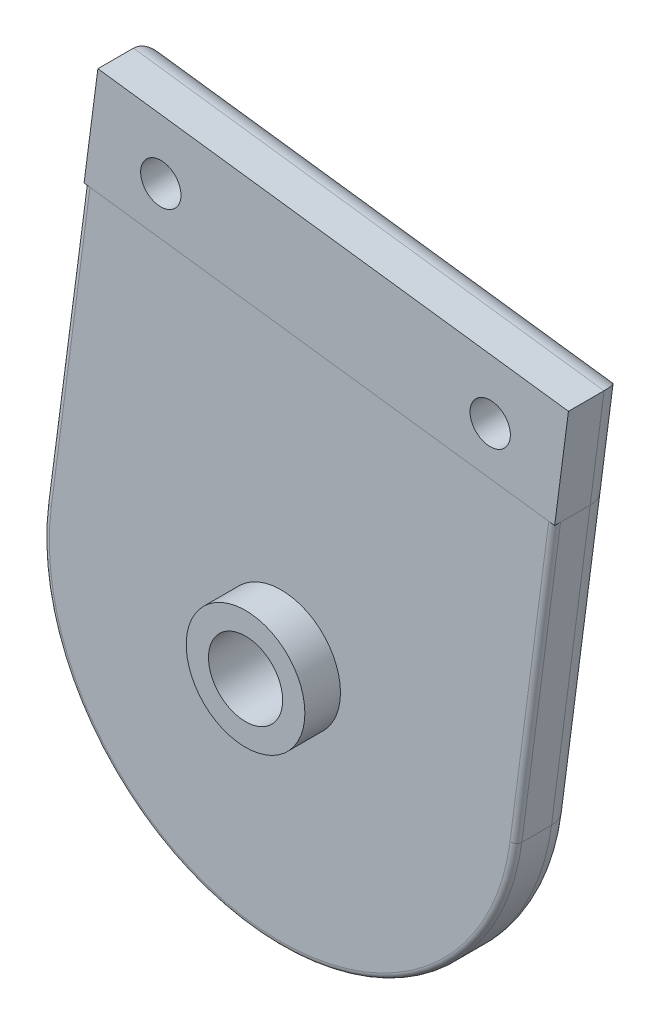
ISO-10303-21;
HEADER;
FILE_DESCRIPTION(('STEP AP214'),'2;1');
FILE_NAME('part.step','',(''),(''),'','','');
FILE_SCHEMA(('AUTOMOTIVE_DESIGN { 1 0 10303 214 1 1 1 1 }'));
ENDSEC;
DATA;
#1=APPLICATION_CONTEXT('core data for automotive mechanical design processes');
#2=APPLICATION_PROTOCOL_DEFINITION('international standard','automotive_design',2000,#1);
#3=PRODUCT_CONTEXT('',#1,'mechanical');
#4=PRODUCT('Part','Part','',(#3));
#5=PRODUCT_RELATED_PRODUCT_CATEGORY('part','',(#4));
#6=PRODUCT_DEFINITION_FORMATION('','',#4);
#7=PRODUCT_DEFINITION_CONTEXT('part definition',#1,'design');
#8=PRODUCT_DEFINITION('design','',#6,#7);
#9=PRODUCT_DEFINITION_SHAPE('','',#8);
#10=(LENGTH_UNIT() NAMED_UNIT(*) SI_UNIT(.MILLI.,.METRE.));
#11=(NAMED_UNIT(*) PLANE_ANGLE_UNIT() SI_UNIT($,.RADIAN.));
#12=(NAMED_UNIT(*) SI_UNIT($,.STERADIAN.) SOLID_ANGLE_UNIT());
#13=UNCERTAINTY_MEASURE_WITH_UNIT(LENGTH_MEASURE(1.E-05),#10,'distance_accuracy_value','');
#14=(GEOMETRIC_REPRESENTATION_CONTEXT(3) GLOBAL_UNCERTAINTY_ASSIGNED_CONTEXT((#13)) GLOBAL_UNIT_ASSIGNED_CONTEXT((#10,
#11,#12)) REPRESENTATION_CONTEXT('',''));
#15=CARTESIAN_POINT('',(0.,0.,0.));
#16=DIRECTION('',(0.,0.,1.));
#17=DIRECTION('',(1.,0.,0.));
#18=AXIS2_PLACEMENT_3D('',#15,#16,#17);
#19=CARTESIAN_POINT('',(158.704164506247,239.24941544385,77.3233826978489));
#20=DIRECTION('',(0.,0.,1.));
#21=DIRECTION('',(0.991589561122965,-0.129422340698834,0.));
#22=AXIS2_PLACEMENT_3D('',#19,#20,#21);
#23=PLANE('',#22);
#24=CARTESIAN_POINT('',(138.43932962902,280.321159697273,77.3233826978489));
#25=DIRECTION('',(0.,0.,1.));
#26=DIRECTION('',(0.991589561122965,-0.129422340698834,0.));
#27=AXIS2_PLACEMENT_3D('',#24,#25,#26);
#28=CIRCLE('',#27,24.765);
#29=CARTESIAN_POINT('',(113.88261414781,283.526303964679,77.3233826978489));
#30=VERTEX_POINT('',#29);
#31=CARTESIAN_POINT('',(162.996045110231,277.116015429866,77.3233826978488));
#32=VERTEX_POINT('',#31);
#33=EDGE_CURVE('P0_E152',#30,#32,#28,.T.);
#34=ORIENTED_EDGE('',*,*,#33,.T.);
#35=DIRECTION('',(0.129422340698834,0.991589561122965,0.));
#36=VECTOR('',#35,1.);
#37=CARTESIAN_POINT('',(167.140247902772,308.867475077959,77.3233826978487));
#38=LINE('',#37,#36);
#39=CARTESIAN_POINT('',(167.140247902772,308.867475077959,77.3233826978487));
#40=VERTEX_POINT('',#39);
#41=EDGE_CURVE('P0_E154',#32,#40,#38,.T.);
#42=ORIENTED_EDGE('',*,*,#41,.T.);
#43=DIRECTION('',(-0.991589561122965,0.129422340698834,0.));
#44=VECTOR('',#43,1.);
#45=CARTESIAN_POINT('',(167.779823169696,308.783997668208,77.3233826978487));
#46=LINE('',#45,#44);
#47=CARTESIAN_POINT('',(118.026816940352,315.277763612772,77.3233826978488));
#48=VERTEX_POINT('',#47);
#49=EDGE_CURVE('P0_E132',#40,#48,#46,.T.);
#50=ORIENTED_EDGE('',*,*,#49,.T.);
#51=DIRECTION('',(-0.129422340698834,-0.991589561122965,0.));
#52=VECTOR('',#51,1.);
#53=CARTESIAN_POINT('',(113.88261414781,283.526303964679,77.3233826978489));
#54=LINE('',#53,#52);
#55=EDGE_CURVE('P0_E120',#48,#30,#54,.T.);
#56=ORIENTED_EDGE('',*,*,#55,.T.);
#57=EDGE_LOOP('',(#34,#42,#50,#56));
#58=FACE_BOUND('',#57,.T.);
#59=CARTESIAN_POINT('',(138.492995873247,281.840569440421,77.3233826978499));
#60=DIRECTION('',(0.,0.,1.));
#61=DIRECTION('',(1.,0.,0.));
#62=AXIS2_PLACEMENT_3D('',#59,#60,#61);
#63=CIRCLE('',#62,6.34999999999999);
#64=CARTESIAN_POINT('',(144.842995873247,281.840569440421,77.3233826978499));
#65=VERTEX_POINT('',#64);
#66=EDGE_CURVE('P0_E173',#65,#65,#63,.T.);
#67=ORIENTED_EDGE('',*,*,#66,.F.);
#68=EDGE_LOOP('',(#67));
#69=FACE_BOUND('',#68,.T.);
#70=ADVANCED_FACE('P0_F43',(#58,#69),#23,.T.);
#71=CARTESIAN_POINT('',(167.769907274085,308.785291891615,70.9633826978488));
#72=DIRECTION('',(0.129422340698834,0.991589561122965,0.));
#73=DIRECTION('',(0.991589561122965,-0.129422340698834,0.));
#74=AXIS2_PLACEMENT_3D('',#71,#72,#73);
#75=PLANE('',#74);
#76=ORIENTED_EDGE('',*,*,#49,.F.);
#77=CARTESIAN_POINT('',(167.140247902772,308.867475077959,76.6883826978488));
#78=DIRECTION('',(0.129422340698834,0.991589561122965,0.));
#79=DIRECTION('',(0.991589561122965,-0.129422340698834,0.));
#80=AXIS2_PLACEMENT_3D('',#77,#78,#79);
#81=CIRCLE('',#80,0.635);
#82=CARTESIAN_POINT('',(167.769907274085,308.785291891615,76.6883826978488));
#83=VERTEX_POINT('',#82);
#84=EDGE_CURVE('P0_E159',#40,#83,#81,.T.);
#85=ORIENTED_EDGE('',*,*,#84,.T.);
#86=DIRECTION('',(0.,0.,-1.));
#87=VECTOR('',#86,1.);
#88=CARTESIAN_POINT('',(167.769907274085,308.785291891615,148.443382697849));
#89=LINE('',#88,#87);
#90=CARTESIAN_POINT('',(167.769907274085,308.785291891615,73.5133826978488));
#91=VERTEX_POINT('',#90);
#92=EDGE_CURVE('P0_E136',#83,#91,#89,.T.);
#93=ORIENTED_EDGE('',*,*,#92,.T.);
#94=CARTESIAN_POINT('',(165.251269788833,309.11402463699,73.5133826978488));
#95=DIRECTION('',(0.129422340698834,0.991589561122965,0.));
#96=DIRECTION('',(0.991589561122965,-0.129422340698834,0.));
#97=AXIS2_PLACEMENT_3D('',#94,#95,#96);
#98=CIRCLE('',#97,2.54);
#99=CARTESIAN_POINT('',(165.251269788833,309.11402463699,70.9733826978487));
#100=VERTEX_POINT('',#99);
#101=EDGE_CURVE('P0_E131',#100,#91,#98,.F.);
#102=ORIENTED_EDGE('',*,*,#101,.F.);
#103=DIRECTION('',(0.991589561122965,-0.129422340698834,0.));
#104=VECTOR('',#103,1.);
#105=CARTESIAN_POINT('',(142.583532421562,312.072619345366,70.9733826978488));
#106=LINE('',#105,#104);
#107=CARTESIAN_POINT('',(119.915795054291,315.031214053741,70.9733826978488));
#108=VERTEX_POINT('',#107);
#109=EDGE_CURVE('P0_E130',#108,#100,#106,.T.);
#110=ORIENTED_EDGE('',*,*,#109,.F.);
#111=CARTESIAN_POINT('',(119.915795054291,315.031214053741,73.5133826978489));
#112=DIRECTION('',(0.129422340698834,0.991589561122965,0.));
#113=DIRECTION('',(0.991589561122965,-0.129422340698834,0.));
#114=AXIS2_PLACEMENT_3D('',#111,#112,#113);
#115=CIRCLE('',#114,2.54);
#116=CARTESIAN_POINT('',(117.397157569039,315.359946799116,73.5133826978489));
#117=VERTEX_POINT('',#116);
#118=EDGE_CURVE('P0_E114',#117,#108,#115,.F.);
#119=ORIENTED_EDGE('',*,*,#118,.F.);
#120=DIRECTION('',(0.,0.,1.));
#121=VECTOR('',#120,1.);
#122=CARTESIAN_POINT('',(117.397157569039,315.359946799116,148.443382697849));
#123=LINE('',#122,#121);
#124=CARTESIAN_POINT('',(117.397157569039,315.359946799116,76.6883826978489));
#125=VERTEX_POINT('',#124);
#126=EDGE_CURVE('P0_E127',#117,#125,#123,.T.);
#127=ORIENTED_EDGE('',*,*,#126,.T.);
#128=CARTESIAN_POINT('',(118.026816940352,315.277763612772,76.6883826978489));
#129=DIRECTION('',(0.129422340698834,0.991589561122965,0.));
#130=DIRECTION('',(0.991589561122965,-0.129422340698834,0.));
#131=AXIS2_PLACEMENT_3D('',#128,#129,#130);
#132=CIRCLE('',#131,0.635);
#133=EDGE_CURVE('P0_E157',#125,#48,#132,.T.);
#134=ORIENTED_EDGE('',*,*,#133,.T.);
#135=EDGE_LOOP('',(#76,#85,#93,#102,#110,#119,#127,#134));
#136=FACE_BOUND('',#135,.T.);
#137=ADVANCED_FACE('P0_F126',(#136),#75,.T.);
#138=CARTESIAN_POINT('',(138.439329629021,280.321159697273,148.443382697849));
#139=DIRECTION('',(0.,0.,-1.));
#140=DIRECTION('',(-0.991589561122965,0.129422340698834,0.));
#141=AXIS2_PLACEMENT_3D('',#138,#139,#140);
#142=CYLINDRICAL_SURFACE('',#141,25.4);
#143=DIRECTION('',(0.,0.,-1.));
#144=VECTOR('',#143,1.);
#145=CARTESIAN_POINT('',(163.625704481544,277.033832243523,148.443382697849));
#146=LINE('',#145,#144);
#147=CARTESIAN_POINT('',(163.625704481544,277.033832243522,76.6883826978488));
#148=VERTEX_POINT('',#147);
#149=CARTESIAN_POINT('',(163.625704481544,277.033832243522,73.5133826978488));
#150=VERTEX_POINT('',#149);
#151=EDGE_CURVE('P0_E177',#148,#150,#146,.T.);
#152=ORIENTED_EDGE('',*,*,#151,.F.);
#153=CARTESIAN_POINT('',(138.43932962902,280.321159697273,76.6883826978489));
#154=DIRECTION('',(0.,0.,1.));
#155=DIRECTION('',(0.991589561122965,-0.129422340698834,0.));
#156=AXIS2_PLACEMENT_3D('',#153,#154,#155);
#157=CIRCLE('',#156,25.4);
#158=CARTESIAN_POINT('',(113.252954776497,283.608487151023,76.6883826978489));
#159=VERTEX_POINT('',#158);
#160=EDGE_CURVE('P0_E52',#148,#159,#157,.F.);
#161=ORIENTED_EDGE('',*,*,#160,.T.);
#162=DIRECTION('',(0.,0.,-1.));
#163=VECTOR('',#162,1.);
#164=CARTESIAN_POINT('',(113.252954776497,283.608487151023,148.443382697849));
#165=LINE('',#164,#163);
#166=CARTESIAN_POINT('',(113.252954776497,283.608487151023,73.5133826978489));
#167=VERTEX_POINT('',#166);
#168=EDGE_CURVE('P0_E179',#159,#167,#165,.T.);
#169=ORIENTED_EDGE('',*,*,#168,.T.);
#170=CARTESIAN_POINT('',(138.43932962902,280.321159697273,73.5133826978489));
#171=DIRECTION('',(0.,0.,-1.));
#172=DIRECTION('',(-0.991589561122965,0.129422340698834,0.));
#173=AXIS2_PLACEMENT_3D('',#170,#171,#172);
#174=CIRCLE('',#173,25.4);
#175=EDGE_CURVE('P0_E146',#167,#150,#174,.F.);
#176=ORIENTED_EDGE('',*,*,#175,.T.);
#177=EDGE_LOOP('',(#152,#161,#169,#176));
#178=FACE_BOUND('',#177,.T.);
#179=ADVANCED_FACE('P0_F212',(#178),#142,.T.);
#180=CARTESIAN_POINT('',(138.43932962902,280.321159697273,73.5133826978489));
#181=DIRECTION('',(0.,0.,-1.));
#182=DIRECTION('',(-0.991589561122965,0.129422340698834,0.));
#183=AXIS2_PLACEMENT_3D('',#180,#181,#182);
#184=TOROIDAL_SURFACE('',#183,22.86,2.54);
#185=CARTESIAN_POINT('',(115.771592261749,283.279754405648,73.5133826978489));
#186=DIRECTION('',(-0.129422340698834,-0.991589561122965,0.));
#187=DIRECTION('',(-0.991589561122965,0.129422340698834,0.));
#188=AXIS2_PLACEMENT_3D('',#185,#186,#187);
#189=CIRCLE('',#188,2.54);
#190=CARTESIAN_POINT('',(115.771592261749,283.279754405648,70.9733826978489));
#191=VERTEX_POINT('',#190);
#192=EDGE_CURVE('P0_E116',#167,#191,#189,.T.);
#193=ORIENTED_EDGE('',*,*,#192,.T.);
#194=CARTESIAN_POINT('',(138.43932962902,280.321159697273,70.9733826978489));
#195=DIRECTION('',(0.,0.,-1.));
#196=DIRECTION('',(-0.991589561122965,0.129422340698834,0.));
#197=AXIS2_PLACEMENT_3D('',#194,#195,#196);
#198=CIRCLE('',#197,22.86);
#199=CARTESIAN_POINT('',(161.107066996291,277.362564988897,70.9733826978488));
#200=VERTEX_POINT('',#199);
#201=EDGE_CURVE('P0_E148',#200,#191,#198,.T.);
#202=ORIENTED_EDGE('',*,*,#201,.F.);
#203=CARTESIAN_POINT('',(161.107066996291,277.362564988897,73.5133826978488));
#204=DIRECTION('',(-0.129422340698834,-0.991589561122965,0.));
#205=DIRECTION('',(-0.991589561122965,0.129422340698834,0.));
#206=AXIS2_PLACEMENT_3D('',#203,#204,#205);
#207=CIRCLE('',#206,2.54);
#208=EDGE_CURVE('P0_E185',#200,#150,#207,.T.);
#209=ORIENTED_EDGE('',*,*,#208,.T.);
#210=ORIENTED_EDGE('',*,*,#175,.F.);
#211=EDGE_LOOP('',(#193,#202,#209,#210));
#212=FACE_BOUND('',#211,.T.);
#213=ADVANCED_FACE('P0_F211',(#212),#184,.T.);
#214=CARTESIAN_POINT('',(161.107066996291,277.362564988897,73.5133826978488));
#215=DIRECTION('',(-0.129422340698834,-0.991589561122965,0.));
#216=DIRECTION('',(-0.991589561122965,0.129422340698834,0.));
#217=AXIS2_PLACEMENT_3D('',#214,#215,#216);
#218=CYLINDRICAL_SURFACE('',#217,2.54);
#219=DIRECTION('',(0.129422340698834,0.991589561122965,0.));
#220=VECTOR('',#219,1.);
#221=CARTESIAN_POINT('',(161.107066996291,277.362564988897,70.9733826978488));
#222=LINE('',#221,#220);
#223=EDGE_CURVE('P0_E145',#100,#200,#222,.F.);
#224=ORIENTED_EDGE('',*,*,#223,.F.);
#225=ORIENTED_EDGE('',*,*,#101,.T.);
#226=DIRECTION('',(0.129422340698834,0.991589561122965,0.));
#227=VECTOR('',#226,1.);
#228=CARTESIAN_POINT('',(169.249204628273,320.119160575251,73.5133826978487));
#229=LINE('',#228,#227);
#230=EDGE_CURVE('P0_E121',#150,#91,#229,.T.);
#231=ORIENTED_EDGE('',*,*,#230,.F.);
#232=ORIENTED_EDGE('',*,*,#208,.F.);
#233=EDGE_LOOP('',(#224,#225,#231,#232));
#234=FACE_BOUND('',#233,.T.);
#235=ADVANCED_FACE('P0_F206',(#234),#218,.T.);
#236=CARTESIAN_POINT('',(115.771592261749,283.279754405648,73.5133826978489));
#237=DIRECTION('',(0.129422340698834,0.991589561122965,0.));
#238=DIRECTION('',(0.991589561122965,-0.129422340698834,0.));
#239=AXIS2_PLACEMENT_3D('',#236,#237,#238);
#240=CYLINDRICAL_SURFACE('',#239,2.54);
#241=DIRECTION('',(-0.129422340698834,-0.991589561122965,0.));
#242=VECTOR('',#241,1.);
#243=CARTESIAN_POINT('',(113.252954776497,283.608487151023,73.5133826978489));
#244=LINE('',#243,#242);
#245=EDGE_CURVE('P0_E110',#117,#167,#244,.T.);
#246=ORIENTED_EDGE('',*,*,#245,.F.);
#247=ORIENTED_EDGE('',*,*,#118,.T.);
#248=DIRECTION('',(-0.129422340698834,-0.991589561122965,0.));
#249=VECTOR('',#248,1.);
#250=CARTESIAN_POINT('',(121.395092408479,326.365082737376,70.9733826978488));
#251=LINE('',#250,#249);
#252=EDGE_CURVE('P0_E143',#191,#108,#251,.F.);
#253=ORIENTED_EDGE('',*,*,#252,.F.);
#254=ORIENTED_EDGE('',*,*,#192,.F.);
#255=EDGE_LOOP('',(#246,#247,#253,#254));
#256=FACE_BOUND('',#255,.T.);
#257=ADVANCED_FACE('P0_F112',(#256),#240,.T.);
#258=CARTESIAN_POINT('',(138.43932962902,280.321159697273,70.9733826978489));
#259=DIRECTION('',(0.,0.,-1.));
#260=DIRECTION('',(-0.991589561122965,0.129422340698834,0.));
#261=AXIS2_PLACEMENT_3D('',#258,#259,#260);
#262=PLANE('',#261);
#263=CARTESIAN_POINT('',(138.492995873247,281.840569440421,70.9733826978487));
#264=DIRECTION('',(0.,0.,1.));
#265=DIRECTION('',(1.,0.,0.));
#266=AXIS2_PLACEMENT_3D('',#263,#264,#265);
#267=CIRCLE('',#266,3.96875);
#268=CARTESIAN_POINT('',(142.461745873247,281.840569440421,70.9733826978487));
#269=VERTEX_POINT('',#268);
#270=EDGE_CURVE('P0_E163',#269,#269,#267,.T.);
#271=ORIENTED_EDGE('',*,*,#270,.T.);
#272=EDGE_LOOP('',(#271));
#273=FACE_BOUND('',#272,.T.);
#274=ORIENTED_EDGE('',*,*,#252,.T.);
#275=ORIENTED_EDGE('',*,*,#109,.T.);
#276=ORIENTED_EDGE('',*,*,#223,.T.);
#277=ORIENTED_EDGE('',*,*,#201,.T.);
#278=EDGE_LOOP('',(#274,#275,#276,#277));
#279=FACE_BOUND('',#278,.T.);
#280=ADVANCED_FACE('P0_F209',(#273,#279),#262,.T.);
#281=CARTESIAN_POINT('',(113.252954776497,283.608487151023,148.443382697849));
#282=DIRECTION('',(0.991589561122965,-0.129422340698834,0.));
#283=DIRECTION('',(-0.129422340698834,-0.991589561122965,0.));
#284=AXIS2_PLACEMENT_3D('',#281,#282,#283);
#285=PLANE('',#284);
#286=ORIENTED_EDGE('',*,*,#168,.F.);
#287=DIRECTION('',(-0.129422340698834,-0.991589561122965,0.));
#288=VECTOR('',#287,1.);
#289=CARTESIAN_POINT('',(117.397157569039,315.359946799116,76.6883826978489));
#290=LINE('',#289,#288);
#291=EDGE_CURVE('P0_E11',#159,#125,#290,.F.);
#292=ORIENTED_EDGE('',*,*,#291,.T.);
#293=ORIENTED_EDGE('',*,*,#126,.F.);
#294=ORIENTED_EDGE('',*,*,#245,.T.);
#295=EDGE_LOOP('',(#286,#292,#293,#294));
#296=FACE_BOUND('',#295,.T.);
#297=ADVANCED_FACE('P0_F134',(#296),#285,.F.);
#298=CARTESIAN_POINT('',(163.625704481544,277.033832243523,148.443382697849));
#299=DIRECTION('',(-0.991589561122965,0.129422340698834,0.));
#300=DIRECTION('',(0.129422340698834,0.991589561122965,0.));
#301=AXIS2_PLACEMENT_3D('',#298,#299,#300);
#302=PLANE('',#301);
#303=ORIENTED_EDGE('',*,*,#92,.F.);
#304=DIRECTION('',(0.129422340698834,0.991589561122965,0.));
#305=VECTOR('',#304,1.);
#306=CARTESIAN_POINT('',(163.625704481544,277.033832243522,76.6883826978488));
#307=LINE('',#306,#305);
#308=EDGE_CURVE('P0_E67',#83,#148,#307,.F.);
#309=ORIENTED_EDGE('',*,*,#308,.T.);
#310=ORIENTED_EDGE('',*,*,#151,.T.);
#311=ORIENTED_EDGE('',*,*,#230,.T.);
#312=EDGE_LOOP('',(#303,#309,#310,#311));
#313=FACE_BOUND('',#312,.T.);
#314=ADVANCED_FACE('P0_F201',(#313),#302,.F.);
#315=CARTESIAN_POINT('',(108.951158276902,245.743181388414,76.688382697849));
#316=DIRECTION('',(0.129422340698834,0.991589561122965,0.));
#317=DIRECTION('',(0.991589561122965,-0.129422340698834,0.));
#318=AXIS2_PLACEMENT_3D('',#315,#316,#317);
#319=CYLINDRICAL_SURFACE('',#318,0.635);
#320=ORIENTED_EDGE('',*,*,#133,.F.);
#321=ORIENTED_EDGE('',*,*,#291,.F.);
#322=CARTESIAN_POINT('',(113.88261414781,283.526303964679,76.6883826978489));
#323=DIRECTION('',(-0.129422340698834,-0.991589561122965,0.));
#324=DIRECTION('',(-0.991589561122965,0.129422340698834,0.));
#325=AXIS2_PLACEMENT_3D('',#322,#323,#324);
#326=CIRCLE('',#325,0.635);
#327=EDGE_CURVE('P0_E47',#30,#159,#326,.T.);
#328=ORIENTED_EDGE('',*,*,#327,.F.);
#329=ORIENTED_EDGE('',*,*,#55,.F.);
#330=EDGE_LOOP('',(#320,#321,#328,#329));
#331=FACE_BOUND('',#330,.T.);
#332=ADVANCED_FACE('P0_F45',(#331),#319,.T.);
#333=CARTESIAN_POINT('',(138.43932962902,280.321159697273,76.6883826978489));
#334=DIRECTION('',(0.,0.,1.));
#335=DIRECTION('',(0.991589561122965,-0.129422340698834,0.));
#336=AXIS2_PLACEMENT_3D('',#333,#334,#335);
#337=TOROIDAL_SURFACE('',#336,24.765,0.635);
#338=ORIENTED_EDGE('',*,*,#327,.T.);
#339=ORIENTED_EDGE('',*,*,#160,.F.);
#340=CARTESIAN_POINT('',(162.996045110231,277.116015429866,76.6883826978488));
#341=DIRECTION('',(0.129422340698834,0.991589561122965,0.));
#342=DIRECTION('',(0.991589561122965,-0.129422340698834,0.));
#343=AXIS2_PLACEMENT_3D('',#340,#341,#342);
#344=CIRCLE('',#343,0.635);
#345=EDGE_CURVE('P0_E140',#32,#148,#344,.T.);
#346=ORIENTED_EDGE('',*,*,#345,.F.);
#347=ORIENTED_EDGE('',*,*,#33,.F.);
#348=EDGE_LOOP('',(#338,#339,#346,#347));
#349=FACE_BOUND('',#348,.T.);
#350=ADVANCED_FACE('P0_F199',(#349),#337,.T.);
#351=CARTESIAN_POINT('',(158.064589239322,239.3328928536,76.688382697849));
#352=DIRECTION('',(-0.129422340698834,-0.991589561122965,0.));
#353=DIRECTION('',(-0.991589561122965,0.129422340698834,0.));
#354=AXIS2_PLACEMENT_3D('',#351,#352,#353);
#355=CYLINDRICAL_SURFACE('',#354,0.635);
#356=ORIENTED_EDGE('',*,*,#345,.T.);
#357=ORIENTED_EDGE('',*,*,#308,.F.);
#358=ORIENTED_EDGE('',*,*,#84,.F.);
#359=ORIENTED_EDGE('',*,*,#41,.F.);
#360=EDGE_LOOP('',(#356,#357,#358,#359));
#361=FACE_BOUND('',#360,.T.);
#362=ADVANCED_FACE('P0_F200',(#361),#355,.T.);
#363=CARTESIAN_POINT('',(138.492995873247,281.840569440421,70.9733826978487));
#364=DIRECTION('',(0.,0.,1.));
#365=DIRECTION('',(1.,0.,0.));
#366=AXIS2_PLACEMENT_3D('',#363,#364,#365);
#367=CYLINDRICAL_SURFACE('',#366,3.96875);
#368=ORIENTED_EDGE('',*,*,#270,.F.);
#369=EDGE_LOOP('',(#368));
#370=FACE_BOUND('',#369,.T.);
#371=CARTESIAN_POINT('',(138.492995873247,281.840569440421,81.1333826978499));
#372=DIRECTION('',(0.,0.,1.));
#373=DIRECTION('',(1.,0.,0.));
#374=AXIS2_PLACEMENT_3D('',#371,#372,#373);
#375=CIRCLE('',#374,3.96875000000002);
#376=CARTESIAN_POINT('',(142.461745873247,281.840569440421,81.1333826978499));
#377=VERTEX_POINT('',#376);
#378=EDGE_CURVE('P0_E322',#377,#377,#375,.T.);
#379=ORIENTED_EDGE('',*,*,#378,.T.);
#380=EDGE_LOOP('',(#379));
#381=FACE_BOUND('',#380,.T.);
#382=ADVANCED_FACE('P0_F238',(#370,#381),#367,.F.);
#383=CARTESIAN_POINT('',(138.492995873247,281.840569440421,81.1333826978499));
#384=DIRECTION('',(0.,0.,1.));
#385=DIRECTION('',(1.,0.,0.));
#386=AXIS2_PLACEMENT_3D('',#383,#384,#385);
#387=PLANE('',#386);
#388=CARTESIAN_POINT('',(138.492995873247,281.840569440421,81.1333826978499));
#389=DIRECTION('',(0.,0.,1.));
#390=DIRECTION('',(1.,0.,0.));
#391=AXIS2_PLACEMENT_3D('',#388,#389,#390);
#392=CIRCLE('',#391,6.34999999999999);
#393=CARTESIAN_POINT('',(144.842995873247,281.840569440421,81.1333826978499));
#394=VERTEX_POINT('',#393);
#395=EDGE_CURVE('P0_E168',#394,#394,#392,.T.);
#396=ORIENTED_EDGE('',*,*,#395,.T.);
#397=EDGE_LOOP('',(#396));
#398=FACE_BOUND('',#397,.T.);
#399=ORIENTED_EDGE('',*,*,#378,.F.);
#400=EDGE_LOOP('',(#399));
#401=FACE_BOUND('',#400,.T.);
#402=ADVANCED_FACE('P0_F300',(#398,#401),#387,.T.);
#403=CARTESIAN_POINT('',(138.492995873247,281.840569440421,81.1333826978499));
#404=DIRECTION('',(0.,0.,-1.));
#405=DIRECTION('',(-1.,0.,0.));
#406=AXIS2_PLACEMENT_3D('',#403,#404,#405);
#407=CYLINDRICAL_SURFACE('',#406,6.34999999999999);
#408=ORIENTED_EDGE('',*,*,#395,.F.);
#409=EDGE_LOOP('',(#408));
#410=FACE_BOUND('',#409,.T.);
#411=ORIENTED_EDGE('',*,*,#66,.T.);
#412=EDGE_LOOP('',(#411));
#413=FACE_BOUND('',#412,.T.);
#414=ADVANCED_FACE('P0_F307',(#410,#413),#407,.T.);
#415=CLOSED_SHELL('',(#70,#137,#179,#213,#235,#257,#280,#297,#314,#332,#350,#362,#382,#402,#414));
#416=MANIFOLD_SOLID_BREP('P0_B2',#415);
#417=CARTESIAN_POINT('',(167.769907274085,308.785291891615,70.9633826978488));
#418=DIRECTION('',(0.129422340698834,0.991589561122965,0.));
#419=DIRECTION('',(0.991589561122965,-0.129422340698834,0.));
#420=AXIS2_PLACEMENT_3D('',#417,#418,#419);
#421=PLANE('',#420);
#422=CARTESIAN_POINT('',(119.915795054291,315.031214053741,73.5133826978489));
#423=DIRECTION('',(0.129422340698834,0.991589561122965,0.));
#424=DIRECTION('',(0.991589561122965,-0.129422340698834,0.));
#425=AXIS2_PLACEMENT_3D('',#422,#423,#424);
#426=CIRCLE('',#425,2.54);
#427=CARTESIAN_POINT('',(117.397157569039,315.359946799116,73.5133826978489));
#428=VERTEX_POINT('',#427);
#429=CARTESIAN_POINT('',(119.915795054291,315.031214053741,70.9733826978488));
#430=VERTEX_POINT('',#429);
#431=EDGE_CURVE('P1_E20',#428,#430,#426,.F.);
#432=ORIENTED_EDGE('',*,*,#431,.T.);
#433=DIRECTION('',(0.991589561122965,-0.129422340698834,0.));
#434=VECTOR('',#433,1.);
#435=CARTESIAN_POINT('',(142.583532421562,312.072619345366,70.9733826978488));
#436=LINE('',#435,#434);
#437=CARTESIAN_POINT('',(165.251269788833,309.11402463699,70.9733826978487));
#438=VERTEX_POINT('',#437);
#439=EDGE_CURVE('P1_E11',#430,#438,#436,.T.);
#440=ORIENTED_EDGE('',*,*,#439,.T.);
#441=CARTESIAN_POINT('',(165.251269788833,309.11402463699,73.5133826978488));
#442=DIRECTION('',(0.129422340698834,0.991589561122965,0.));
#443=DIRECTION('',(0.991589561122965,-0.129422340698834,0.));
#444=AXIS2_PLACEMENT_3D('',#441,#442,#443);
#445=CIRCLE('',#444,2.54);
#446=CARTESIAN_POINT('',(167.769907274085,308.785291891615,73.5133826978488));
#447=VERTEX_POINT('',#446);
#448=EDGE_CURVE('P1_E25',#438,#447,#445,.F.);
#449=ORIENTED_EDGE('',*,*,#448,.T.);
#450=DIRECTION('',(0.,0.,-1.));
#451=VECTOR('',#450,1.);
#452=CARTESIAN_POINT('',(167.769907274085,308.785291891615,148.443382697849));
#453=LINE('',#452,#451);
#454=CARTESIAN_POINT('',(167.769907274085,308.785291891615,77.3233826978487));
#455=VERTEX_POINT('',#454);
#456=EDGE_CURVE('P1_E111',#455,#447,#453,.T.);
#457=ORIENTED_EDGE('',*,*,#456,.F.);
#458=DIRECTION('',(-0.991589561122965,0.129422340698834,0.));
#459=VECTOR('',#458,1.);
#460=CARTESIAN_POINT('',(167.779823169696,308.783997668208,77.3233826978487));
#461=LINE('',#460,#459);
#462=CARTESIAN_POINT('',(117.397157569039,315.359946799116,77.3233826978489));
#463=VERTEX_POINT('',#462);
#464=EDGE_CURVE('P1_E78',#455,#463,#461,.T.);
#465=ORIENTED_EDGE('',*,*,#464,.T.);
#466=DIRECTION('',(0.,0.,1.));
#467=VECTOR('',#466,1.);
#468=CARTESIAN_POINT('',(117.397157569039,315.359946799116,148.443382697849));
#469=LINE('',#468,#467);
#470=EDGE_CURVE('P1_E109',#428,#463,#469,.T.);
#471=ORIENTED_EDGE('',*,*,#470,.F.);
#472=EDGE_LOOP('',(#432,#440,#449,#457,#465,#471));
#473=FACE_BOUND('',#472,.T.);
#474=ADVANCED_FACE('P1_F17',(#473),#421,.F.);
#475=CARTESIAN_POINT('',(158.704164506247,239.24941544385,77.3233826978489));
#476=DIRECTION('',(0.,0.,1.));
#477=DIRECTION('',(0.991589561122965,-0.129422340698834,0.));
#478=AXIS2_PLACEMENT_3D('',#475,#476,#477);
#479=PLANE('',#478);
#480=ORIENTED_EDGE('',*,*,#464,.F.);
#481=DIRECTION('',(0.129422340698834,0.991589561122965,0.));
#482=VECTOR('',#481,1.);
#483=CARTESIAN_POINT('',(163.625704481544,277.033832243522,77.3233826978488));
#484=LINE('',#483,#482);
#485=CARTESIAN_POINT('',(169.249204628273,320.119160575251,77.3233826978487));
#486=VERTEX_POINT('',#485);
#487=EDGE_CURVE('P1_E70',#455,#486,#484,.T.);
#488=ORIENTED_EDGE('',*,*,#487,.T.);
#489=DIRECTION('',(-0.991589561122965,0.129422340698834,0.));
#490=VECTOR('',#489,1.);
#491=CARTESIAN_POINT('',(140.435025871247,323.879989255038,77.3233826978488));
#492=LINE('',#491,#490);
#493=CARTESIAN_POINT('',(118.876454923226,326.693815482752,77.3233826978488));
#494=VERTEX_POINT('',#493);
#495=EDGE_CURVE('P1_E76',#486,#494,#492,.T.);
#496=ORIENTED_EDGE('',*,*,#495,.T.);
#497=DIRECTION('',(-0.129422340698834,-0.991589561122965,0.));
#498=VECTOR('',#497,1.);
#499=CARTESIAN_POINT('',(113.252954776497,283.608487151023,77.3233826978489));
#500=LINE('',#499,#498);
#501=EDGE_CURVE('P1_E82',#494,#463,#500,.T.);
#502=ORIENTED_EDGE('',*,*,#501,.T.);
#503=EDGE_LOOP('',(#480,#488,#496,#502));
#504=FACE_BOUND('',#503,.T.);
#505=CARTESIAN_POINT('',(160.871460309078,314.808765098245,77.3233826978487));
#506=DIRECTION('',(0.,0.,1.));
#507=DIRECTION('',(0.991589561122965,-0.129422340698834,0.));
#508=AXIS2_PLACEMENT_3D('',#505,#506,#507);
#509=CIRCLE('',#508,2.159);
#510=CARTESIAN_POINT('',(163.012302171543,314.529342264676,77.3233826978487));
#511=VERTEX_POINT('',#510);
#512=EDGE_CURVE('P1_E96',#511,#511,#509,.F.);
#513=ORIENTED_EDGE('',*,*,#512,.T.);
#514=EDGE_LOOP('',(#513));
#515=FACE_BOUND('',#514,.T.);
#516=CARTESIAN_POINT('',(125.610535515546,319.411023533496,77.3233826978488));
#517=DIRECTION('',(0.,0.,1.));
#518=DIRECTION('',(0.991589561122965,-0.129422340698834,0.));
#519=AXIS2_PLACEMENT_3D('',#516,#517,#518);
#520=CIRCLE('',#519,2.159);
#521=CARTESIAN_POINT('',(127.75137737801,319.131600699927,77.3233826978488));
#522=VERTEX_POINT('',#521);
#523=EDGE_CURVE('P1_E101',#522,#522,#520,.F.);
#524=ORIENTED_EDGE('',*,*,#523,.T.);
#525=EDGE_LOOP('',(#524));
#526=FACE_BOUND('',#525,.T.);
#527=ADVANCED_FACE('P1_F72',(#504,#515,#526),#479,.T.);
#528=CARTESIAN_POINT('',(143.734097030374,320.887850543749,73.5133826978488));
#529=DIRECTION('',(-0.991589561122965,0.129422340698834,0.));
#530=DIRECTION('',(0.129422340698834,0.991589561122965,0.));
#531=AXIS2_PLACEMENT_3D('',#528,#529,#530);
#532=CYLINDRICAL_SURFACE('',#531,2.54);
#533=CARTESIAN_POINT('',(166.401834397645,317.929255835373,73.5133826978487));
#534=DIRECTION('',(-0.60964428807866,0.792675117569023,0.));
#535=DIRECTION('',(-0.792675117569023,-0.60964428807866,0.));
#536=AXIS2_PLACEMENT_3D('',#533,#534,#535);
#537=ELLIPSE('',#536,3.59210244842766,2.54);
#538=CARTESIAN_POINT('',(166.401834397645,317.929255835373,70.9733826978487));
#539=VERTEX_POINT('',#538);
#540=CARTESIAN_POINT('',(169.249204628273,320.119160575251,73.5133826978487));
#541=VERTEX_POINT('',#540);
#542=EDGE_CURVE('P1_E112',#539,#541,#537,.F.);
#543=ORIENTED_EDGE('',*,*,#542,.F.);
#544=DIRECTION('',(0.991589561122965,-0.129422340698834,0.));
#545=VECTOR('',#544,1.);
#546=CARTESIAN_POINT('',(168.920471882898,317.600523089998,70.9733826978487));
#547=LINE('',#546,#545);
#548=CARTESIAN_POINT('',(121.066359663103,323.846445252124,70.9733826978488));
#549=VERTEX_POINT('',#548);
#550=EDGE_CURVE('P1_E126',#549,#539,#547,.T.);
#551=ORIENTED_EDGE('',*,*,#550,.F.);
#552=CARTESIAN_POINT('',(121.066359663103,323.846445252124,73.5133826978488));
#553=DIRECTION('',(-0.792675117569023,-0.60964428807866,0.));
#554=DIRECTION('',(-0.60964428807866,0.792675117569023,0.));
#555=AXIS2_PLACEMENT_3D('',#552,#553,#554);
#556=ELLIPSE('',#555,3.59210244842766,2.54);
#557=CARTESIAN_POINT('',(118.876454923226,326.693815482752,73.5133826978488));
#558=VERTEX_POINT('',#557);
#559=EDGE_CURVE('P1_E124',#558,#549,#556,.T.);
#560=ORIENTED_EDGE('',*,*,#559,.F.);
#561=DIRECTION('',(0.991589561122965,-0.129422340698834,0.));
#562=VECTOR('',#561,1.);
#563=CARTESIAN_POINT('',(118.876454923226,326.693815482752,73.5133826978488));
#564=LINE('',#563,#562);
#565=EDGE_CURVE('P1_E95',#541,#558,#564,.F.);
#566=ORIENTED_EDGE('',*,*,#565,.F.);
#567=EDGE_LOOP('',(#543,#551,#560,#566));
#568=FACE_BOUND('',#567,.T.);
#569=ADVANCED_FACE('P1_F151',(#568),#532,.T.);
#570=CARTESIAN_POINT('',(115.771592261749,283.279754405648,73.5133826978489));
#571=DIRECTION('',(0.129422340698834,0.991589561122965,0.));
#572=DIRECTION('',(0.991589561122965,-0.129422340698834,0.));
#573=AXIS2_PLACEMENT_3D('',#570,#571,#572);
#574=CYLINDRICAL_SURFACE('',#573,2.54);
#575=ORIENTED_EDGE('',*,*,#431,.F.);
#576=DIRECTION('',(-0.129422340698834,-0.991589561122965,0.));
#577=VECTOR('',#576,1.);
#578=CARTESIAN_POINT('',(113.252954776497,283.608487151023,73.5133826978489));
#579=LINE('',#578,#577);
#580=EDGE_CURVE('P1_E98',#558,#428,#579,.T.);
#581=ORIENTED_EDGE('',*,*,#580,.F.);
#582=ORIENTED_EDGE('',*,*,#559,.T.);
#583=DIRECTION('',(-0.129422340698834,-0.991589561122965,0.));
#584=VECTOR('',#583,1.);
#585=CARTESIAN_POINT('',(121.395092408479,326.365082737376,70.9733826978488));
#586=LINE('',#585,#584);
#587=EDGE_CURVE('P1_E121',#430,#549,#586,.F.);
#588=ORIENTED_EDGE('',*,*,#587,.F.);
#589=EDGE_LOOP('',(#575,#581,#582,#588));
#590=FACE_BOUND('',#589,.T.);
#591=ADVANCED_FACE('P1_F122',(#590),#574,.T.);
#592=CARTESIAN_POINT('',(140.435025871247,323.879989255038,139.485182065867));
#593=DIRECTION('',(-0.129422340698834,-0.991589561122965,0.));
#594=DIRECTION('',(-0.991589561122965,0.129422340698834,0.));
#595=AXIS2_PLACEMENT_3D('',#592,#593,#594);
#596=PLANE('',#595);
#597=ORIENTED_EDGE('',*,*,#495,.F.);
#598=DIRECTION('',(0.,0.,-1.));
#599=VECTOR('',#598,1.);
#600=CARTESIAN_POINT('',(169.249204628273,320.119160575251,148.443382697849));
#601=LINE('',#600,#599);
#602=EDGE_CURVE('P1_E85',#486,#541,#601,.T.);
#603=ORIENTED_EDGE('',*,*,#602,.T.);
#604=ORIENTED_EDGE('',*,*,#565,.T.);
#605=DIRECTION('',(0.,0.,-1.));
#606=VECTOR('',#605,1.);
#607=CARTESIAN_POINT('',(118.876454923226,326.693815482752,148.443382697849));
#608=LINE('',#607,#606);
#609=EDGE_CURVE('P1_E81',#494,#558,#608,.T.);
#610=ORIENTED_EDGE('',*,*,#609,.F.);
#611=EDGE_LOOP('',(#597,#603,#604,#610));
#612=FACE_BOUND('',#611,.T.);
#613=ADVANCED_FACE('P1_F94',(#612),#596,.F.);
#614=CARTESIAN_POINT('',(161.107066996291,277.362564988897,73.5133826978488));
#615=DIRECTION('',(-0.129422340698834,-0.991589561122965,0.));
#616=DIRECTION('',(-0.991589561122965,0.129422340698834,0.));
#617=AXIS2_PLACEMENT_3D('',#614,#615,#616);
#618=CYLINDRICAL_SURFACE('',#617,2.54);
#619=ORIENTED_EDGE('',*,*,#448,.F.);
#620=DIRECTION('',(0.129422340698834,0.991589561122965,0.));
#621=VECTOR('',#620,1.);
#622=CARTESIAN_POINT('',(161.107066996291,277.362564988897,70.9733826978488));
#623=LINE('',#622,#621);
#624=EDGE_CURVE('P1_E127',#539,#438,#623,.F.);
#625=ORIENTED_EDGE('',*,*,#624,.F.);
#626=ORIENTED_EDGE('',*,*,#542,.T.);
#627=DIRECTION('',(0.129422340698834,0.991589561122965,0.));
#628=VECTOR('',#627,1.);
#629=CARTESIAN_POINT('',(169.249204628273,320.119160575251,73.5133826978487));
#630=LINE('',#629,#628);
#631=EDGE_CURVE('P1_E87',#447,#541,#630,.T.);
#632=ORIENTED_EDGE('',*,*,#631,.F.);
#633=EDGE_LOOP('',(#619,#625,#626,#632));
#634=FACE_BOUND('',#633,.T.);
#635=ADVANCED_FACE('P1_F173',(#634),#618,.T.);
#636=CARTESIAN_POINT('',(163.625704481544,277.033832243523,148.443382697849));
#637=DIRECTION('',(-0.991589561122965,0.129422340698834,0.));
#638=DIRECTION('',(0.129422340698834,0.991589561122965,0.));
#639=AXIS2_PLACEMENT_3D('',#636,#637,#638);
#640=PLANE('',#639);
#641=ORIENTED_EDGE('',*,*,#487,.F.);
#642=ORIENTED_EDGE('',*,*,#456,.T.);
#643=ORIENTED_EDGE('',*,*,#631,.T.);
#644=ORIENTED_EDGE('',*,*,#602,.F.);
#645=EDGE_LOOP('',(#641,#642,#643,#644));
#646=FACE_BOUND('',#645,.T.);
#647=ADVANCED_FACE('P1_F86',(#646),#640,.F.);
#648=CARTESIAN_POINT('',(113.252954776497,283.608487151023,148.443382697849));
#649=DIRECTION('',(0.991589561122965,-0.129422340698834,0.));
#650=DIRECTION('',(-0.129422340698834,-0.991589561122965,0.));
#651=AXIS2_PLACEMENT_3D('',#648,#649,#650);
#652=PLANE('',#651);
#653=ORIENTED_EDGE('',*,*,#580,.T.);
#654=ORIENTED_EDGE('',*,*,#470,.T.);
#655=ORIENTED_EDGE('',*,*,#501,.F.);
#656=ORIENTED_EDGE('',*,*,#609,.T.);
#657=EDGE_LOOP('',(#653,#654,#655,#656));
#658=FACE_BOUND('',#657,.T.);
#659=ADVANCED_FACE('P1_F168',(#658),#652,.F.);
#660=CARTESIAN_POINT('',(138.43932962902,280.321159697273,70.9733826978489));
#661=DIRECTION('',(0.,0.,-1.));
#662=DIRECTION('',(-0.991589561122965,0.129422340698834,0.));
#663=AXIS2_PLACEMENT_3D('',#660,#661,#662);
#664=PLANE('',#663);
#665=ORIENTED_EDGE('',*,*,#439,.F.);
#666=ORIENTED_EDGE('',*,*,#587,.T.);
#667=ORIENTED_EDGE('',*,*,#550,.T.);
#668=ORIENTED_EDGE('',*,*,#624,.T.);
#669=EDGE_LOOP('',(#665,#666,#667,#668));
#670=FACE_BOUND('',#669,.T.);
#671=CARTESIAN_POINT('',(125.610535515546,319.411023533496,70.9733826978488));
#672=DIRECTION('',(0.,0.,1.));
#673=DIRECTION('',(0.991589561122965,-0.129422340698834,0.));
#674=AXIS2_PLACEMENT_3D('',#671,#672,#673);
#675=CIRCLE('',#674,2.159);
#676=CARTESIAN_POINT('',(127.75137737801,319.131600699927,70.9733826978488));
#677=VERTEX_POINT('',#676);
#678=EDGE_CURVE('P1_E91',#677,#677,#675,.T.);
#679=ORIENTED_EDGE('',*,*,#678,.T.);
#680=EDGE_LOOP('',(#679));
#681=FACE_BOUND('',#680,.T.);
#682=CARTESIAN_POINT('',(160.871460309078,314.808765098245,70.9733826978487));
#683=DIRECTION('',(0.,0.,1.));
#684=DIRECTION('',(-0.991589561122965,0.129422340698834,0.));
#685=AXIS2_PLACEMENT_3D('',#682,#683,#684);
#686=CIRCLE('',#685,2.159);
#687=CARTESIAN_POINT('',(158.730618446614,315.088187931814,70.9733826978487));
#688=VERTEX_POINT('',#687);
#689=EDGE_CURVE('P1_E133',#688,#688,#686,.T.);
#690=ORIENTED_EDGE('',*,*,#689,.T.);
#691=EDGE_LOOP('',(#690));
#692=FACE_BOUND('',#691,.T.);
#693=ADVANCED_FACE('P1_F141',(#670,#681,#692),#664,.T.);
#694=CARTESIAN_POINT('',(125.610535515546,319.411023533496,70.9733826978488));
#695=DIRECTION('',(0.,0.,1.));
#696=DIRECTION('',(0.991589561122965,-0.129422340698834,0.));
#697=AXIS2_PLACEMENT_3D('',#694,#695,#696);
#698=CYLINDRICAL_SURFACE('',#697,2.159);
#699=ORIENTED_EDGE('',*,*,#678,.F.);
#700=EDGE_LOOP('',(#699));
#701=FACE_BOUND('',#700,.T.);
#702=ORIENTED_EDGE('',*,*,#523,.F.);
#703=EDGE_LOOP('',(#702));
#704=FACE_BOUND('',#703,.T.);
#705=ADVANCED_FACE('P1_F143',(#701,#704),#698,.F.);
#706=CARTESIAN_POINT('',(160.871460309078,314.808765098245,70.9733826978487));
#707=DIRECTION('',(0.,0.,1.));
#708=DIRECTION('',(0.991589561122965,-0.129422340698834,0.));
#709=AXIS2_PLACEMENT_3D('',#706,#707,#708);
#710=CYLINDRICAL_SURFACE('',#709,2.159);
#711=ORIENTED_EDGE('',*,*,#689,.F.);
#712=EDGE_LOOP('',(#711));
#713=FACE_BOUND('',#712,.T.);
#714=ORIENTED_EDGE('',*,*,#512,.F.);
#715=EDGE_LOOP('',(#714));
#716=FACE_BOUND('',#715,.T.);
#717=ADVANCED_FACE('P1_F146',(#713,#716),#710,.F.);
#718=CLOSED_SHELL('',(#474,#527,#569,#591,#613,#635,#647,#659,#693,#705,#717));
#719=MANIFOLD_SOLID_BREP('P1_B1',#718);
#720=ADVANCED_BREP_SHAPE_REPRESENTATION('',(#18,#416,#719),#14);
#721=SHAPE_DEFINITION_REPRESENTATION(#9,#720);
ENDSEC;
END-ISO-10303-21;
